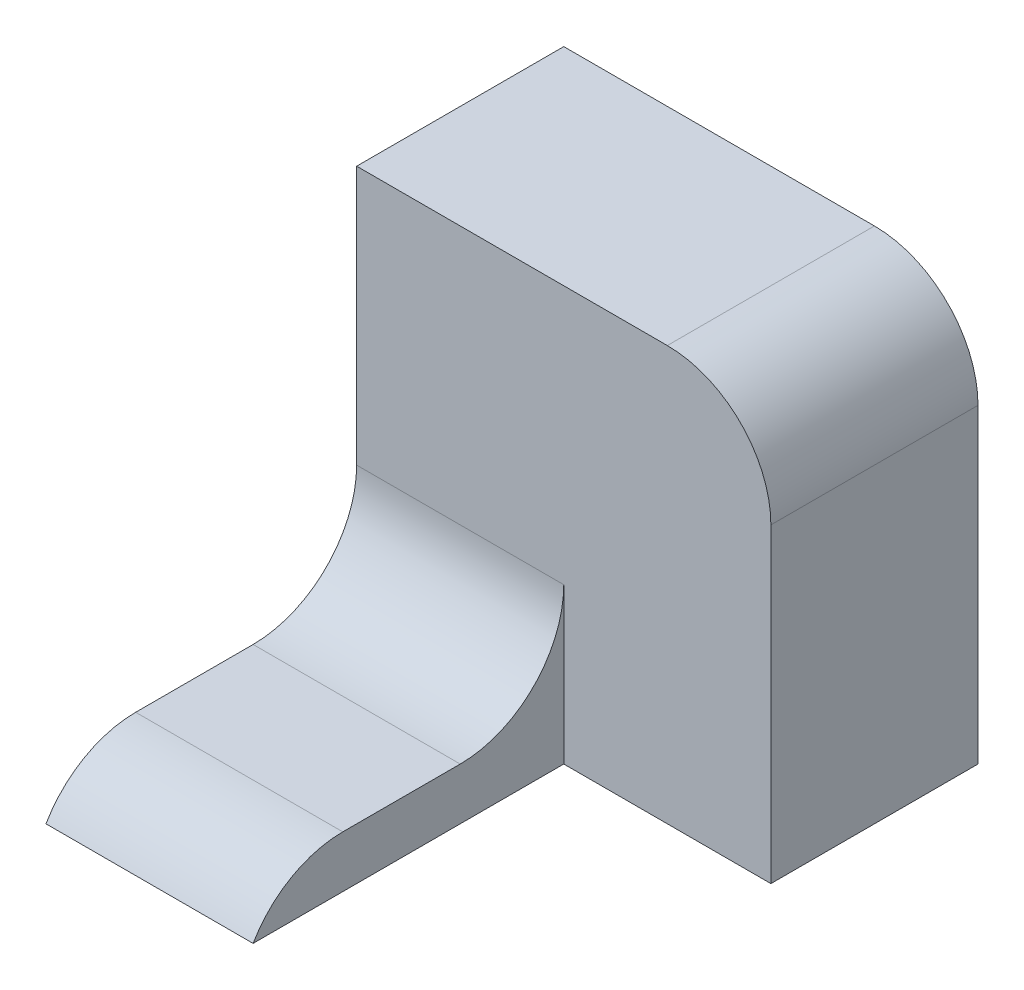
ISO-10303-21;
HEADER;
FILE_DESCRIPTION(('STEP AP214'),'2;1');
FILE_NAME('part.step','',(''),(''),'','','');
FILE_SCHEMA(('AUTOMOTIVE_DESIGN { 1 0 10303 214 1 1 1 1 }'));
ENDSEC;
DATA;
#1=APPLICATION_CONTEXT('core data for automotive mechanical design processes');
#2=APPLICATION_PROTOCOL_DEFINITION('international standard','automotive_design',2000,#1);
#3=PRODUCT_CONTEXT('',#1,'mechanical');
#4=PRODUCT('Part','Part','',(#3));
#5=PRODUCT_RELATED_PRODUCT_CATEGORY('part','',(#4));
#6=PRODUCT_DEFINITION_FORMATION('','',#4);
#7=PRODUCT_DEFINITION_CONTEXT('part definition',#1,'design');
#8=PRODUCT_DEFINITION('design','',#6,#7);
#9=PRODUCT_DEFINITION_SHAPE('','',#8);
#10=(LENGTH_UNIT() NAMED_UNIT(*) SI_UNIT(.MILLI.,.METRE.));
#11=(NAMED_UNIT(*) PLANE_ANGLE_UNIT() SI_UNIT($,.RADIAN.));
#12=(NAMED_UNIT(*) SI_UNIT($,.STERADIAN.) SOLID_ANGLE_UNIT());
#13=UNCERTAINTY_MEASURE_WITH_UNIT(LENGTH_MEASURE(1.E-05),#10,'distance_accuracy_value','');
#14=(GEOMETRIC_REPRESENTATION_CONTEXT(3) GLOBAL_UNCERTAINTY_ASSIGNED_CONTEXT((#13)) GLOBAL_UNIT_ASSIGNED_CONTEXT((#10,
#11,#12)) REPRESENTATION_CONTEXT('',''));
#15=CARTESIAN_POINT('',(0.,0.,0.));
#16=DIRECTION('',(0.,0.,1.));
#17=DIRECTION('',(1.,0.,0.));
#18=AXIS2_PLACEMENT_3D('',#15,#16,#17);
#19=CARTESIAN_POINT('',(-10.,0.,30.));
#20=DIRECTION('',(0.,-1.,0.));
#21=DIRECTION('',(1.,0.,0.));
#22=AXIS2_PLACEMENT_3D('',#19,#20,#21);
#23=PLANE('',#22);
#24=DIRECTION('',(0.,0.,-1.));
#25=VECTOR('',#24,1.);
#26=CARTESIAN_POINT('',(-10.,0.,30.));
#27=LINE('',#26,#25);
#28=CARTESIAN_POINT('',(-10.,0.,21.3397459621556));
#29=VERTEX_POINT('',#28);
#30=CARTESIAN_POINT('',(-10.,0.,10.));
#31=VERTEX_POINT('',#30);
#32=EDGE_CURVE('E144',#29,#31,#27,.T.);
#33=ORIENTED_EDGE('',*,*,#32,.T.);
#34=DIRECTION('',(-1.,0.,0.));
#35=VECTOR('',#34,1.);
#36=CARTESIAN_POINT('',(-10.,0.,10.));
#37=LINE('',#36,#35);
#38=CARTESIAN_POINT('',(-30.,0.,10.));
#39=VERTEX_POINT('',#38);
#40=EDGE_CURVE('E158',#31,#39,#37,.T.);
#41=ORIENTED_EDGE('',*,*,#40,.T.);
#42=DIRECTION('',(0.,0.,-1.));
#43=VECTOR('',#42,1.);
#44=CARTESIAN_POINT('',(-30.,0.,30.));
#45=LINE('',#44,#43);
#46=CARTESIAN_POINT('',(-30.,0.,21.3397459621556));
#47=VERTEX_POINT('',#46);
#48=EDGE_CURVE('E153',#47,#39,#45,.T.);
#49=ORIENTED_EDGE('',*,*,#48,.F.);
#50=DIRECTION('',(-1.,0.,0.));
#51=VECTOR('',#50,1.);
#52=CARTESIAN_POINT('',(-10.,0.,21.3397459621556));
#53=LINE('',#52,#51);
#54=EDGE_CURVE('E156',#47,#29,#53,.F.);
#55=ORIENTED_EDGE('',*,*,#54,.T.);
#56=EDGE_LOOP('',(#33,#41,#49,#55));
#57=FACE_BOUND('',#56,.T.);
#58=ADVANCED_FACE('F35',(#57),#23,.F.);
#59=CARTESIAN_POINT('',(-30.,0.,30.));
#60=DIRECTION('',(1.,0.,0.));
#61=DIRECTION('',(0.,0.,-1.));
#62=AXIS2_PLACEMENT_3D('',#59,#60,#61);
#63=PLANE('',#62);
#64=DIRECTION('',(0.,0.,-1.));
#65=VECTOR('',#64,1.);
#66=CARTESIAN_POINT('',(-30.,-5.,30.));
#67=LINE('',#66,#65);
#68=CARTESIAN_POINT('',(-30.,-5.,30.));
#69=VERTEX_POINT('',#68);
#70=CARTESIAN_POINT('',(-30.,-5.,-20.));
#71=VERTEX_POINT('',#70);
#72=EDGE_CURVE('E151',#69,#71,#67,.T.);
#73=ORIENTED_EDGE('',*,*,#72,.F.);
#74=CARTESIAN_POINT('',(-30.,-10.,21.3397459621556));
#75=DIRECTION('',(1.,0.,0.));
#76=DIRECTION('',(0.,0.,-1.));
#77=AXIS2_PLACEMENT_3D('',#74,#75,#76);
#78=CIRCLE('',#77,10.);
#79=EDGE_CURVE('E171',#69,#47,#78,.F.);
#80=ORIENTED_EDGE('',*,*,#79,.T.);
#81=ORIENTED_EDGE('',*,*,#48,.T.);
#82=CARTESIAN_POINT('',(-30.,10.,10.));
#83=DIRECTION('',(1.,0.,0.));
#84=DIRECTION('',(0.,0.,-1.));
#85=AXIS2_PLACEMENT_3D('',#82,#83,#84);
#86=CIRCLE('',#85,10.);
#87=CARTESIAN_POINT('',(-30.,10.,0.));
#88=VERTEX_POINT('',#87);
#89=EDGE_CURVE('E43',#39,#88,#86,.T.);
#90=ORIENTED_EDGE('',*,*,#89,.T.);
#91=DIRECTION('',(0.,-1.,0.));
#92=VECTOR('',#91,1.);
#93=CARTESIAN_POINT('',(-30.,35.,0.));
#94=LINE('',#93,#92);
#95=CARTESIAN_POINT('',(-30.,35.,0.));
#96=VERTEX_POINT('',#95);
#97=EDGE_CURVE('E119',#96,#88,#94,.T.);
#98=ORIENTED_EDGE('',*,*,#97,.F.);
#99=DIRECTION('',(0.,0.,1.));
#100=VECTOR('',#99,1.);
#101=CARTESIAN_POINT('',(-30.,35.,-20.));
#102=LINE('',#101,#100);
#103=CARTESIAN_POINT('',(-30.,35.,-20.));
#104=VERTEX_POINT('',#103);
#105=EDGE_CURVE('E108',#104,#96,#102,.T.);
#106=ORIENTED_EDGE('',*,*,#105,.F.);
#107=DIRECTION('',(0.,-1.,0.));
#108=VECTOR('',#107,1.);
#109=CARTESIAN_POINT('',(-30.,35.,-20.));
#110=LINE('',#109,#108);
#111=EDGE_CURVE('E111',#104,#71,#110,.T.);
#112=ORIENTED_EDGE('',*,*,#111,.T.);
#113=EDGE_LOOP('',(#73,#80,#81,#90,#98,#106,#112));
#114=FACE_BOUND('',#113,.T.);
#115=ADVANCED_FACE('F117',(#114),#63,.F.);
#116=CARTESIAN_POINT('',(-30.,-5.,30.));
#117=DIRECTION('',(0.,1.,0.));
#118=DIRECTION('',(0.,0.,1.));
#119=AXIS2_PLACEMENT_3D('',#116,#117,#118);
#120=PLANE('',#119);
#121=ORIENTED_EDGE('',*,*,#72,.T.);
#122=DIRECTION('',(1.,0.,0.));
#123=VECTOR('',#122,1.);
#124=CARTESIAN_POINT('',(-30.,-5.,-20.));
#125=LINE('',#124,#123);
#126=CARTESIAN_POINT('',(10.,-5.,-20.));
#127=VERTEX_POINT('',#126);
#128=EDGE_CURVE('E126',#71,#127,#125,.T.);
#129=ORIENTED_EDGE('',*,*,#128,.T.);
#130=DIRECTION('',(0.,0.,1.));
#131=VECTOR('',#130,1.);
#132=CARTESIAN_POINT('',(10.,-5.,-20.));
#133=LINE('',#132,#131);
#134=CARTESIAN_POINT('',(10.,-5.,0.));
#135=VERTEX_POINT('',#134);
#136=EDGE_CURVE('E120',#127,#135,#133,.T.);
#137=ORIENTED_EDGE('',*,*,#136,.T.);
#138=DIRECTION('',(1.,0.,0.));
#139=VECTOR('',#138,1.);
#140=CARTESIAN_POINT('',(-30.,-5.,0.));
#141=LINE('',#140,#139);
#142=CARTESIAN_POINT('',(-10.,-5.,0.));
#143=VERTEX_POINT('',#142);
#144=EDGE_CURVE('E134',#143,#135,#141,.T.);
#145=ORIENTED_EDGE('',*,*,#144,.F.);
#146=DIRECTION('',(0.,0.,-1.));
#147=VECTOR('',#146,1.);
#148=CARTESIAN_POINT('',(-10.,-5.,30.));
#149=LINE('',#148,#147);
#150=CARTESIAN_POINT('',(-10.,-5.,30.));
#151=VERTEX_POINT('',#150);
#152=EDGE_CURVE('E148',#151,#143,#149,.T.);
#153=ORIENTED_EDGE('',*,*,#152,.F.);
#154=DIRECTION('',(1.,0.,0.));
#155=VECTOR('',#154,1.);
#156=CARTESIAN_POINT('',(-30.,-5.,30.));
#157=LINE('',#156,#155);
#158=EDGE_CURVE('E141',#69,#151,#157,.T.);
#159=ORIENTED_EDGE('',*,*,#158,.F.);
#160=EDGE_LOOP('',(#121,#129,#137,#145,#153,#159));
#161=FACE_BOUND('',#160,.T.);
#162=ADVANCED_FACE('F193',(#161),#120,.F.);
#163=CARTESIAN_POINT('',(-10.,-5.,30.));
#164=DIRECTION('',(-1.,0.,0.));
#165=DIRECTION('',(0.,0.,1.));
#166=AXIS2_PLACEMENT_3D('',#163,#164,#165);
#167=PLANE('',#166);
#168=ORIENTED_EDGE('',*,*,#32,.F.);
#169=CARTESIAN_POINT('',(-10.,-10.,21.3397459621556));
#170=DIRECTION('',(-1.,0.,0.));
#171=DIRECTION('',(0.,0.,1.));
#172=AXIS2_PLACEMENT_3D('',#169,#170,#171);
#173=CIRCLE('',#172,10.);
#174=EDGE_CURVE('E173',#29,#151,#173,.F.);
#175=ORIENTED_EDGE('',*,*,#174,.T.);
#176=ORIENTED_EDGE('',*,*,#152,.T.);
#177=DIRECTION('',(0.,1.,0.));
#178=VECTOR('',#177,1.);
#179=CARTESIAN_POINT('',(-10.,-5.,0.));
#180=LINE('',#179,#178);
#181=CARTESIAN_POINT('',(-10.,10.,0.));
#182=VERTEX_POINT('',#181);
#183=EDGE_CURVE('E139',#143,#182,#180,.T.);
#184=ORIENTED_EDGE('',*,*,#183,.T.);
#185=CARTESIAN_POINT('',(-10.,10.,10.));
#186=DIRECTION('',(-1.,0.,0.));
#187=DIRECTION('',(0.,0.,1.));
#188=AXIS2_PLACEMENT_3D('',#185,#186,#187);
#189=CIRCLE('',#188,10.);
#190=EDGE_CURVE('E11',#182,#31,#189,.T.);
#191=ORIENTED_EDGE('',*,*,#190,.T.);
#192=EDGE_LOOP('',(#168,#175,#176,#184,#191));
#193=FACE_BOUND('',#192,.T.);
#194=ADVANCED_FACE('F184',(#193),#167,.F.);
#195=CARTESIAN_POINT('',(0.,0.,0.));
#196=DIRECTION('',(0.,0.,1.));
#197=DIRECTION('',(1.,0.,0.));
#198=AXIS2_PLACEMENT_3D('',#195,#196,#197);
#199=PLANE('',#198);
#200=ORIENTED_EDGE('',*,*,#97,.T.);
#201=DIRECTION('',(-1.,0.,0.));
#202=VECTOR('',#201,1.);
#203=CARTESIAN_POINT('',(0.,10.,0.));
#204=LINE('',#203,#202);
#205=EDGE_CURVE('E163',#88,#182,#204,.F.);
#206=ORIENTED_EDGE('',*,*,#205,.T.);
#207=ORIENTED_EDGE('',*,*,#183,.F.);
#208=ORIENTED_EDGE('',*,*,#144,.T.);
#209=DIRECTION('',(0.,1.,0.));
#210=VECTOR('',#209,1.);
#211=CARTESIAN_POINT('',(10.,-5.,0.));
#212=LINE('',#211,#210);
#213=CARTESIAN_POINT('',(10.,25.,0.));
#214=VERTEX_POINT('',#213);
#215=EDGE_CURVE('E112',#135,#214,#212,.T.);
#216=ORIENTED_EDGE('',*,*,#215,.T.);
#217=CARTESIAN_POINT('',(0.,25.,0.));
#218=DIRECTION('',(0.,0.,1.));
#219=DIRECTION('',(1.,0.,0.));
#220=AXIS2_PLACEMENT_3D('',#217,#218,#219);
#221=CIRCLE('',#220,10.);
#222=CARTESIAN_POINT('',(0.,35.,0.));
#223=VERTEX_POINT('',#222);
#224=EDGE_CURVE('E161',#214,#223,#221,.T.);
#225=ORIENTED_EDGE('',*,*,#224,.T.);
#226=DIRECTION('',(-1.,0.,0.));
#227=VECTOR('',#226,1.);
#228=CARTESIAN_POINT('',(10.,35.,0.));
#229=LINE('',#228,#227);
#230=EDGE_CURVE('E131',#223,#96,#229,.T.);
#231=ORIENTED_EDGE('',*,*,#230,.T.);
#232=EDGE_LOOP('',(#200,#206,#207,#208,#216,#225,#231));
#233=FACE_BOUND('',#232,.T.);
#234=ADVANCED_FACE('F179',(#233),#199,.T.);
#235=CARTESIAN_POINT('',(10.,35.,-20.));
#236=DIRECTION('',(0.,1.,0.));
#237=DIRECTION('',(-1.,0.,0.));
#238=AXIS2_PLACEMENT_3D('',#235,#236,#237);
#239=PLANE('',#238);
#240=ORIENTED_EDGE('',*,*,#230,.F.);
#241=DIRECTION('',(0.,0.,1.));
#242=VECTOR('',#241,1.);
#243=CARTESIAN_POINT('',(0.,35.,-20.));
#244=LINE('',#243,#242);
#245=CARTESIAN_POINT('',(0.,35.,-20.));
#246=VERTEX_POINT('',#245);
#247=EDGE_CURVE('E50',#223,#246,#244,.F.);
#248=ORIENTED_EDGE('',*,*,#247,.T.);
#249=DIRECTION('',(-1.,0.,0.));
#250=VECTOR('',#249,1.);
#251=CARTESIAN_POINT('',(10.,35.,-20.));
#252=LINE('',#251,#250);
#253=EDGE_CURVE('E105',#246,#104,#252,.T.);
#254=ORIENTED_EDGE('',*,*,#253,.T.);
#255=ORIENTED_EDGE('',*,*,#105,.T.);
#256=EDGE_LOOP('',(#240,#248,#254,#255));
#257=FACE_BOUND('',#256,.T.);
#258=ADVANCED_FACE('F107',(#257),#239,.T.);
#259=CARTESIAN_POINT('',(10.,-5.,-20.));
#260=DIRECTION('',(1.,0.,0.));
#261=DIRECTION('',(0.,0.,-1.));
#262=AXIS2_PLACEMENT_3D('',#259,#260,#261);
#263=PLANE('',#262);
#264=DIRECTION('',(0.,1.,0.));
#265=VECTOR('',#264,1.);
#266=CARTESIAN_POINT('',(10.,-5.,-20.));
#267=LINE('',#266,#265);
#268=CARTESIAN_POINT('',(10.,25.,-20.));
#269=VERTEX_POINT('',#268);
#270=EDGE_CURVE('E121',#127,#269,#267,.T.);
#271=ORIENTED_EDGE('',*,*,#270,.T.);
#272=DIRECTION('',(0.,0.,1.));
#273=VECTOR('',#272,1.);
#274=CARTESIAN_POINT('',(10.,25.,-20.));
#275=LINE('',#274,#273);
#276=EDGE_CURVE('E166',#269,#214,#275,.T.);
#277=ORIENTED_EDGE('',*,*,#276,.T.);
#278=ORIENTED_EDGE('',*,*,#215,.F.);
#279=ORIENTED_EDGE('',*,*,#136,.F.);
#280=EDGE_LOOP('',(#271,#277,#278,#279));
#281=FACE_BOUND('',#280,.T.);
#282=ADVANCED_FACE('F196',(#281),#263,.T.);
#283=CARTESIAN_POINT('',(0.,0.,-20.));
#284=DIRECTION('',(0.,0.,1.));
#285=DIRECTION('',(1.,0.,0.));
#286=AXIS2_PLACEMENT_3D('',#283,#284,#285);
#287=PLANE('',#286);
#288=ORIENTED_EDGE('',*,*,#253,.F.);
#289=CARTESIAN_POINT('',(0.,25.,-20.));
#290=DIRECTION('',(0.,0.,1.));
#291=DIRECTION('',(1.,0.,0.));
#292=AXIS2_PLACEMENT_3D('',#289,#290,#291);
#293=CIRCLE('',#292,10.);
#294=EDGE_CURVE('E57',#246,#269,#293,.F.);
#295=ORIENTED_EDGE('',*,*,#294,.T.);
#296=ORIENTED_EDGE('',*,*,#270,.F.);
#297=ORIENTED_EDGE('',*,*,#128,.F.);
#298=ORIENTED_EDGE('',*,*,#111,.F.);
#299=EDGE_LOOP('',(#288,#295,#296,#297,#298));
#300=FACE_BOUND('',#299,.T.);
#301=ADVANCED_FACE('F124',(#300),#287,.F.);
#302=CARTESIAN_POINT('',(-10.,10.,10.));
#303=DIRECTION('',(-1.,0.,0.));
#304=DIRECTION('',(0.,-1.,0.));
#305=AXIS2_PLACEMENT_3D('',#302,#303,#304);
#306=CYLINDRICAL_SURFACE('',#305,10.);
#307=ORIENTED_EDGE('',*,*,#190,.F.);
#308=ORIENTED_EDGE('',*,*,#205,.F.);
#309=ORIENTED_EDGE('',*,*,#89,.F.);
#310=ORIENTED_EDGE('',*,*,#40,.F.);
#311=EDGE_LOOP('',(#307,#308,#309,#310));
#312=FACE_BOUND('',#311,.T.);
#313=ADVANCED_FACE('F181',(#312),#306,.F.);
#314=CARTESIAN_POINT('',(0.,25.,-20.));
#315=DIRECTION('',(0.,0.,1.));
#316=DIRECTION('',(1.,0.,0.));
#317=AXIS2_PLACEMENT_3D('',#314,#315,#316);
#318=CYLINDRICAL_SURFACE('',#317,10.);
#319=ORIENTED_EDGE('',*,*,#294,.F.);
#320=ORIENTED_EDGE('',*,*,#247,.F.);
#321=ORIENTED_EDGE('',*,*,#224,.F.);
#322=ORIENTED_EDGE('',*,*,#276,.F.);
#323=EDGE_LOOP('',(#319,#320,#321,#322));
#324=FACE_BOUND('',#323,.T.);
#325=ADVANCED_FACE('F199',(#324),#318,.T.);
#326=CARTESIAN_POINT('',(0.,-10.,21.3397459621556));
#327=DIRECTION('',(-1.,0.,0.));
#328=DIRECTION('',(0.,0.,1.));
#329=AXIS2_PLACEMENT_3D('',#326,#327,#328);
#330=CYLINDRICAL_SURFACE('',#329,10.);
#331=ORIENTED_EDGE('',*,*,#174,.F.);
#332=ORIENTED_EDGE('',*,*,#54,.F.);
#333=ORIENTED_EDGE('',*,*,#79,.F.);
#334=ORIENTED_EDGE('',*,*,#158,.T.);
#335=EDGE_LOOP('',(#331,#332,#333,#334));
#336=FACE_BOUND('',#335,.T.);
#337=ADVANCED_FACE('F37',(#336),#330,.T.);
#338=CLOSED_SHELL('',(#58,#115,#162,#194,#234,#258,#282,#301,#313,#325,#337));
#339=MANIFOLD_SOLID_BREP('B2',#338);
#340=ADVANCED_BREP_SHAPE_REPRESENTATION('',(#18,#339),#14);
#341=SHAPE_DEFINITION_REPRESENTATION(#9,#340);
ENDSEC;
END-ISO-10303-21;
